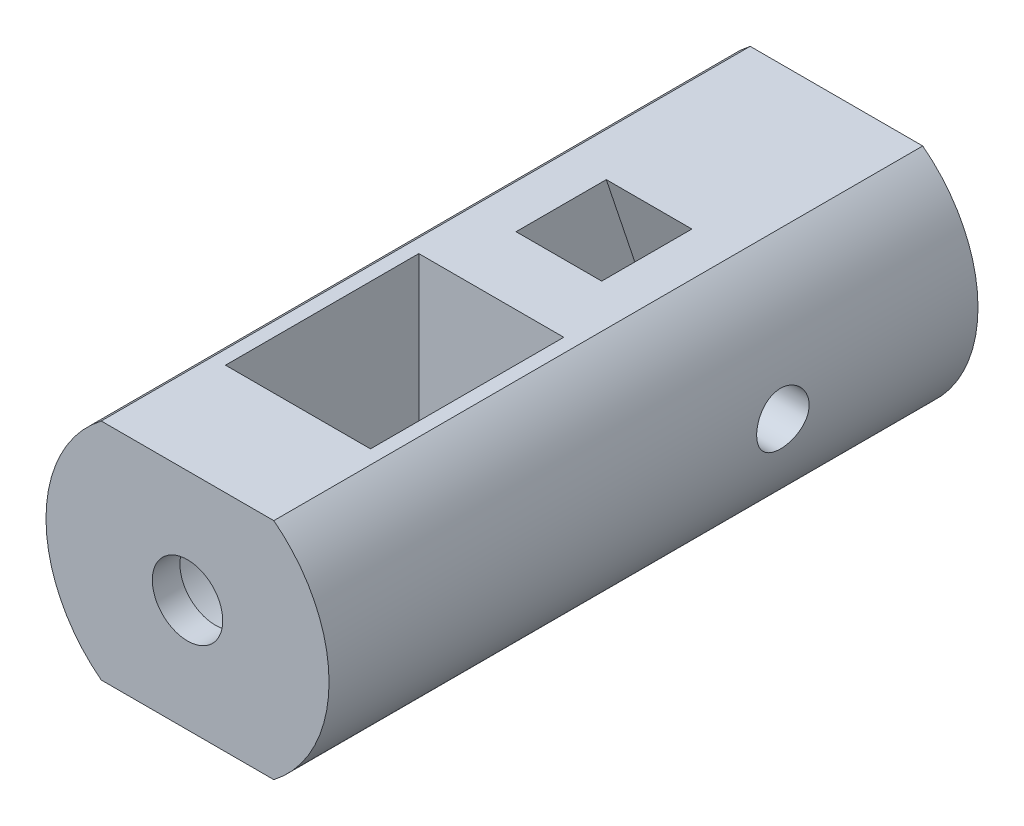
ISO-10303-21;
HEADER;
FILE_DESCRIPTION(('STEP AP214'),'2;1');
FILE_NAME('part.step','',(''),(''),'','','');
FILE_SCHEMA(('AUTOMOTIVE_DESIGN { 1 0 10303 214 1 1 1 1 }'));
ENDSEC;
DATA;
#1=APPLICATION_CONTEXT('core data for automotive mechanical design processes');
#2=APPLICATION_PROTOCOL_DEFINITION('international standard','automotive_design',2000,#1);
#3=PRODUCT_CONTEXT('',#1,'mechanical');
#4=PRODUCT('Part','Part','',(#3));
#5=PRODUCT_RELATED_PRODUCT_CATEGORY('part','',(#4));
#6=PRODUCT_DEFINITION_FORMATION('','',#4);
#7=PRODUCT_DEFINITION_CONTEXT('part definition',#1,'design');
#8=PRODUCT_DEFINITION('design','',#6,#7);
#9=PRODUCT_DEFINITION_SHAPE('','',#8);
#10=(LENGTH_UNIT() NAMED_UNIT(*) SI_UNIT(.MILLI.,.METRE.));
#11=(NAMED_UNIT(*) PLANE_ANGLE_UNIT() SI_UNIT($,.RADIAN.));
#12=(NAMED_UNIT(*) SI_UNIT($,.STERADIAN.) SOLID_ANGLE_UNIT());
#13=UNCERTAINTY_MEASURE_WITH_UNIT(LENGTH_MEASURE(1.E-05),#10,'distance_accuracy_value','');
#14=(GEOMETRIC_REPRESENTATION_CONTEXT(3) GLOBAL_UNCERTAINTY_ASSIGNED_CONTEXT((#13)) GLOBAL_UNIT_ASSIGNED_CONTEXT((#10,
#11,#12)) REPRESENTATION_CONTEXT('',''));
#15=CARTESIAN_POINT('',(0.,0.,0.));
#16=DIRECTION('',(0.,0.,1.));
#17=DIRECTION('',(1.,0.,0.));
#18=AXIS2_PLACEMENT_3D('',#15,#16,#17);
#19=CARTESIAN_POINT('',(5.25,325.527766903838,156.639));
#20=DIRECTION('',(0.,0.,1.));
#21=DIRECTION('',(1.,0.,0.));
#22=AXIS2_PLACEMENT_3D('',#19,#20,#21);
#23=PLANE('',#22);
#24=DIRECTION('',(0.,-1.,0.));
#25=VECTOR('',#24,1.);
#26=CARTESIAN_POINT('',(5.25,325.527766903838,156.639));
#27=LINE('',#26,#25);
#28=CARTESIAN_POINT('',(5.25,325.527766903838,156.639));
#29=VERTEX_POINT('',#28);
#30=CARTESIAN_POINT('',(5.25,317.403728499202,156.639));
#31=VERTEX_POINT('',#30);
#32=EDGE_CURVE('E290',#29,#31,#27,.T.);
#33=ORIENTED_EDGE('',*,*,#32,.T.);
#34=CARTESIAN_POINT('',(0.,317.403728499202,156.639));
#35=DIRECTION('',(0.,0.,-1.));
#36=DIRECTION('',(-1.,0.,0.));
#37=AXIS2_PLACEMENT_3D('',#34,#35,#36);
#38=CIRCLE('',#37,5.25000000000001);
#39=CARTESIAN_POINT('',(-5.25,317.403728499202,156.639));
#40=VERTEX_POINT('',#39);
#41=EDGE_CURVE('E55',#40,#31,#38,.T.);
#42=ORIENTED_EDGE('',*,*,#41,.F.);
#43=DIRECTION('',(0.,-1.,0.));
#44=VECTOR('',#43,1.);
#45=CARTESIAN_POINT('',(-5.25,325.527766903838,156.639));
#46=LINE('',#45,#44);
#47=CARTESIAN_POINT('',(-5.25,325.527766903838,156.639));
#48=VERTEX_POINT('',#47);
#49=EDGE_CURVE('E95',#48,#40,#46,.T.);
#50=ORIENTED_EDGE('',*,*,#49,.F.);
#51=DIRECTION('',(-1.,0.,0.));
#52=VECTOR('',#51,1.);
#53=CARTESIAN_POINT('',(5.25,325.527766903838,156.639));
#54=LINE('',#53,#52);
#55=EDGE_CURVE('E293',#29,#48,#54,.T.);
#56=ORIENTED_EDGE('',*,*,#55,.F.);
#57=EDGE_LOOP('',(#33,#42,#50,#56));
#58=FACE_BOUND('',#57,.T.);
#59=ADVANCED_FACE('F36',(#58),#23,.F.);
#60=CARTESIAN_POINT('',(0.,317.403728499202,164.639));
#61=DIRECTION('',(0.,0.,-1.));
#62=DIRECTION('',(-1.,0.,0.));
#63=AXIS2_PLACEMENT_3D('',#60,#61,#62);
#64=CYLINDRICAL_SURFACE('',#63,10.25);
#65=CARTESIAN_POINT('',(10.25,317.403728499202,133.668709538287));
#66=CARTESIAN_POINT('',(10.2499980928548,317.297975435781,133.66870547407));
#67=CARTESIAN_POINT('',(10.2483464451302,317.192169238842,133.65985045826));
#68=CARTESIAN_POINT('',(10.2419168741179,316.983536895782,133.624686293486));
#69=CARTESIAN_POINT('',(10.2371362869479,316.880713366982,133.598362271685));
#70=CARTESIAN_POINT('',(10.2249837608471,316.681093941061,133.529092579384));
#71=CARTESIAN_POINT('',(10.2176141391839,316.58429274466,133.486161769021));
#72=CARTESIAN_POINT('',(10.201088893425,316.399276520248,133.384938986293));
#73=CARTESIAN_POINT('',(10.1919334202721,316.311060767528,133.32664831202));
#74=CARTESIAN_POINT('',(10.1727275421145,316.144676674545,133.195635306742));
#75=CARTESIAN_POINT('',(10.1626687542421,316.06662348126,133.122767954954));
#76=CARTESIAN_POINT('',(10.1428523589127,315.923776128299,132.964982015465));
#77=CARTESIAN_POINT('',(10.1330947728365,315.858982908052,132.880062574631));
#78=CARTESIAN_POINT('',(10.1149041281788,315.744017678456,132.699771678283));
#79=CARTESIAN_POINT('',(10.106481880874,315.693962452892,132.604324567091));
#80=CARTESIAN_POINT('',(10.0920334444708,315.610641613005,132.406193736844));
#81=CARTESIAN_POINT('',(10.0860070536381,315.57737458503,132.303510627927));
#82=CARTESIAN_POINT('',(10.0771169404786,315.528943299968,132.095053471079));
#83=CARTESIAN_POINT('',(10.0742181993274,315.513578441751,131.989327552121));
#84=CARTESIAN_POINT('',(10.0718059763868,315.500765066804,131.776761709367));
#85=CARTESIAN_POINT('',(10.0722921979701,315.503314980188,131.669921884003));
#86=CARTESIAN_POINT('',(10.0765630708267,315.526096025373,131.459612039586));
#87=CARTESIAN_POINT('',(10.0803052228379,315.5460993494,131.356116353755));
#88=CARTESIAN_POINT('',(10.0905995804368,315.602860766917,131.153975820668));
#89=CARTESIAN_POINT('',(10.0971519029789,315.639619557744,131.055331175495));
#90=CARTESIAN_POINT('',(10.1123729069467,315.729072123961,130.865024672177));
#91=CARTESIAN_POINT('',(10.121053784825,315.781858165026,130.773407198783));
#92=CARTESIAN_POINT('',(10.1395456765845,315.90180154985,130.600244207295));
#93=CARTESIAN_POINT('',(10.1493568026046,315.968960320183,130.518699690268));
#94=CARTESIAN_POINT('',(10.1691890743521,316.116972408385,130.366680880684));
#95=CARTESIAN_POINT('',(10.1792111279809,316.198020643876,130.296396349063));
#96=CARTESIAN_POINT('',(10.1981971233661,316.370858019668,130.170392981237));
#97=CARTESIAN_POINT('',(10.2071610549639,316.462647263076,130.114674284869));
#98=CARTESIAN_POINT('',(10.2230382945575,316.654556936287,130.019357436737));
#99=CARTESIAN_POINT('',(10.2299491300279,316.754687226912,129.97977870099));
#100=CARTESIAN_POINT('',(10.2409223370096,316.960331496721,129.918055424468));
#101=CARTESIAN_POINT('',(10.2449850041513,317.065844915936,129.89590907424));
#102=CARTESIAN_POINT('',(10.2497636063984,317.277627404262,129.869942608806));
#103=CARTESIAN_POINT('',(10.2505270288068,317.383863551839,129.865862438883));
#104=CARTESIAN_POINT('',(10.2487521795687,317.595500215366,129.875447041943));
#105=CARTESIAN_POINT('',(10.2462140663205,317.700900771159,129.889110963616));
#106=CARTESIAN_POINT('',(10.2381508826968,317.90705178097,129.933579658695));
#107=CARTESIAN_POINT('',(10.2326486986208,318.007831526919,129.964253149782));
#108=CARTESIAN_POINT('',(10.2192717674232,318.202817993486,130.041728436695));
#109=CARTESIAN_POINT('',(10.2113968620782,318.29702427524,130.088531308129));
#110=CARTESIAN_POINT('',(10.1940295699932,318.477301623471,130.19751452124));
#111=CARTESIAN_POINT('',(10.1845207672933,318.563274783848,130.259854147634));
#112=CARTESIAN_POINT('',(10.1649835036326,318.723632946761,130.397925356542));
#113=CARTESIAN_POINT('',(10.1549549953804,318.798016892244,130.473658159306));
#114=CARTESIAN_POINT('',(10.1353514808124,318.934070714818,130.63754212224));
#115=CARTESIAN_POINT('',(10.1257840372581,318.995563303987,130.725841518365));
#116=CARTESIAN_POINT('',(10.1083369168713,319.102843287401,130.911669461341));
#117=CARTESIAN_POINT('',(10.1004571782064,319.148631257053,131.009197669886));
#118=CARTESIAN_POINT('',(10.0873367199244,319.222949401487,131.210259793608));
#119=CARTESIAN_POINT('',(10.0820834805117,319.251561582153,131.3137625421));
#120=CARTESIAN_POINT('',(10.0747818991975,319.290969457772,131.524212537455));
#121=CARTESIAN_POINT('',(10.0727332048221,319.301767112185,131.631159404173));
#122=CARTESIAN_POINT('',(10.0720902675276,319.305175025358,131.843686585155));
#123=CARTESIAN_POINT('',(10.0734429208813,319.298064868007,131.949262357129));
#124=CARTESIAN_POINT('',(10.0793326644954,319.266470281166,132.157686147152));
#125=CARTESIAN_POINT('',(10.0838697367461,319.241985949937,132.260534180625));
#126=CARTESIAN_POINT('',(10.0955949726872,319.1764548587,132.460437155635));
#127=CARTESIAN_POINT('',(10.1027783945489,319.135437710517,132.557502100327));
#128=CARTESIAN_POINT('',(10.1189904132999,319.038035671418,132.743417389088));
#129=CARTESIAN_POINT('',(10.1280191364473,318.981649728859,132.832267170459));
#130=CARTESIAN_POINT('',(10.1470696727455,318.854135904176,133.000631819478));
#131=CARTESIAN_POINT('',(10.1571040886309,318.782804302846,133.07999099691));
#132=CARTESIAN_POINT('',(10.1769404422877,318.627849385959,133.22570678517));
#133=CARTESIAN_POINT('',(10.1867423261127,318.54422324989,133.292060404198));
#134=CARTESIAN_POINT('',(10.2051099218599,318.366175110823,133.410424000964));
#135=CARTESIAN_POINT('',(10.2136640394701,318.271664865346,133.462303090404));
#136=CARTESIAN_POINT('',(10.2284591506668,318.075142501036,133.549364174907));
#137=CARTESIAN_POINT('',(10.2347023299185,317.973137580626,133.584561955885));
#138=CARTESIAN_POINT('',(10.2428895790578,317.79297303197,133.630061149416));
#139=CARTESIAN_POINT('',(10.2455410162713,317.715870888263,133.644529696382));
#140=CARTESIAN_POINT('',(10.2490969120148,317.560431701603,133.663855279188));
#141=CARTESIAN_POINT('',(10.2500014132518,317.482094688885,133.668712549994));
#142=CARTESIAN_POINT('',(10.25,317.403728499202,133.668709538287));
#143=B_SPLINE_CURVE_WITH_KNOTS('',3,(#65,#66,#67,#68,#69,#70,#71,#72,#73,#74,#75,#76,#77,#78,
#79,#80,#81,#82,#83,#84,#85,#86,#87,#88,#89,#90,#91,#92,#93,#94,#95,#96,#97,#98,#99,#100,#101,
#102,#103,#104,#105,#106,#107,#108,#109,#110,#111,#112,#113,#114,#115,#116,#117,#118,#119,#120,
#121,#122,#123,#124,#125,#126,#127,#128,#129,#130,#131,#132,#133,#134,#135,#136,#137,#138,#139,
#140,#141,#142),.UNSPECIFIED.,.T.,.F.,(4,2,2,2,2,2,2,2,2,2,2,2,2,2,2,2,2,2,2,2,2,2,2,2,2,2,2,2,
2,2,2,2,2,2,2,2,2,2,4),(0.,0.316972615312287,0.634215442956177,0.951175048645203,
1.26810787604101,1.5883664569062,1.90864771930201,2.23140250568416,2.5541301099291,
2.87320554111227,3.1922530117766,3.50719743124776,3.82215495942192,4.13896116453682,
4.45579882907314,4.77751440283142,5.09923306504545,5.42133761404919,5.74340872472436,
6.06082836923402,6.37823278540525,6.69322085507704,7.00822993417953,7.32661189477882,
7.64502287806666,7.96756090152934,8.29008710613105,8.61106090015209,8.93199938719378,
9.24795841283077,9.56391565156097,9.8793094782536,10.1947248918659,10.5147575627577,
10.8348637678117,11.1577771208717,11.480384280219,11.7152762310882,11.9501624395111),.UNSPECIFIED.);
#144=CARTESIAN_POINT('',(10.25,317.403728499202,133.668709538287));
#145=VERTEX_POINT('',#144);
#146=EDGE_CURVE('E49',#145,#145,#143,.T.);
#147=ORIENTED_EDGE('',*,*,#146,.F.);
#148=EDGE_LOOP('',(#147));
#149=FACE_BOUND('',#148,.T.);
#150=CARTESIAN_POINT('',(0.,317.403728499202,117.639));
#151=DIRECTION('',(0.,0.,-1.));
#152=DIRECTION('',(-1.,0.,0.));
#153=AXIS2_PLACEMENT_3D('',#150,#151,#152);
#154=CIRCLE('',#153,10.25);
#155=CARTESIAN_POINT('',(6.25,325.527766903838,117.639));
#156=VERTEX_POINT('',#155);
#157=CARTESIAN_POINT('',(6.25,309.279690094566,117.639));
#158=VERTEX_POINT('',#157);
#159=EDGE_CURVE('E189',#156,#158,#154,.T.);
#160=ORIENTED_EDGE('',*,*,#159,.F.);
#161=DIRECTION('',(0.,0.,-1.));
#162=VECTOR('',#161,1.);
#163=CARTESIAN_POINT('',(6.25,325.527766903838,164.639));
#164=LINE('',#163,#162);
#165=CARTESIAN_POINT('',(6.25,325.527766903838,164.639));
#166=VERTEX_POINT('',#165);
#167=EDGE_CURVE('E201',#166,#156,#164,.T.);
#168=ORIENTED_EDGE('',*,*,#167,.F.);
#169=CARTESIAN_POINT('',(0.,317.403728499202,164.639));
#170=DIRECTION('',(0.,0.,-1.));
#171=DIRECTION('',(-1.,0.,0.));
#172=AXIS2_PLACEMENT_3D('',#169,#170,#171);
#173=CIRCLE('',#172,10.25);
#174=CARTESIAN_POINT('',(6.25,309.279690094566,164.639));
#175=VERTEX_POINT('',#174);
#176=EDGE_CURVE('E175',#166,#175,#173,.T.);
#177=ORIENTED_EDGE('',*,*,#176,.T.);
#178=DIRECTION('',(0.,0.,-1.));
#179=VECTOR('',#178,1.);
#180=CARTESIAN_POINT('',(6.25,309.279690094566,164.639));
#181=LINE('',#180,#179);
#182=EDGE_CURVE('E188',#175,#158,#181,.T.);
#183=ORIENTED_EDGE('',*,*,#182,.T.);
#184=EDGE_LOOP('',(#160,#168,#177,#183));
#185=FACE_BOUND('',#184,.T.);
#186=ADVANCED_FACE('F219',(#149,#185),#64,.T.);
#187=CARTESIAN_POINT('',(-6.25,325.527766903838,164.639));
#188=DIRECTION('',(0.,1.,0.));
#189=DIRECTION('',(0.,0.,1.));
#190=AXIS2_PLACEMENT_3D('',#187,#188,#189);
#191=PLANE('',#190);
#192=DIRECTION('',(0.,0.,-1.));
#193=VECTOR('',#192,1.);
#194=CARTESIAN_POINT('',(-5.25,325.527766903838,156.639));
#195=LINE('',#194,#193);
#196=CARTESIAN_POINT('',(-5.25,325.527766903838,142.639));
#197=VERTEX_POINT('',#196);
#198=EDGE_CURVE('E323',#48,#197,#195,.T.);
#199=ORIENTED_EDGE('',*,*,#198,.T.);
#200=DIRECTION('',(1.,0.,0.));
#201=VECTOR('',#200,1.);
#202=CARTESIAN_POINT('',(-5.25,325.527766903838,142.639));
#203=LINE('',#202,#201);
#204=CARTESIAN_POINT('',(5.25,325.527766903838,142.639));
#205=VERTEX_POINT('',#204);
#206=EDGE_CURVE('E310',#197,#205,#203,.T.);
#207=ORIENTED_EDGE('',*,*,#206,.T.);
#208=DIRECTION('',(0.,0.,1.));
#209=VECTOR('',#208,1.);
#210=CARTESIAN_POINT('',(5.25,325.527766903838,142.639));
#211=LINE('',#210,#209);
#212=EDGE_CURVE('E64',#205,#29,#211,.T.);
#213=ORIENTED_EDGE('',*,*,#212,.T.);
#214=ORIENTED_EDGE('',*,*,#55,.T.);
#215=EDGE_LOOP('',(#199,#207,#213,#214));
#216=FACE_BOUND('',#215,.T.);
#217=DIRECTION('',(0.,0.,1.));
#218=VECTOR('',#217,1.);
#219=CARTESIAN_POINT('',(-3.1,325.527766903838,125.793009821235));
#220=LINE('',#219,#218);
#221=CARTESIAN_POINT('',(-3.1,325.527766903838,131.209035424326));
#222=VERTEX_POINT('',#221);
#223=CARTESIAN_POINT('',(-3.1,325.527766903838,137.74440925534));
#224=VERTEX_POINT('',#223);
#225=EDGE_CURVE('E171',#222,#224,#220,.T.);
#226=ORIENTED_EDGE('',*,*,#225,.F.);
#227=DIRECTION('',(1.,0.,0.));
#228=VECTOR('',#227,1.);
#229=CARTESIAN_POINT('',(-6.25,325.527766903838,131.209035424326));
#230=LINE('',#229,#228);
#231=CARTESIAN_POINT('',(3.1,325.527766903838,131.209035424326));
#232=VERTEX_POINT('',#231);
#233=EDGE_CURVE('E166',#232,#222,#230,.F.);
#234=ORIENTED_EDGE('',*,*,#233,.F.);
#235=DIRECTION('',(0.,0.,-1.));
#236=VECTOR('',#235,1.);
#237=CARTESIAN_POINT('',(3.1,325.527766903838,132.328383652249));
#238=LINE('',#237,#236);
#239=CARTESIAN_POINT('',(3.1,325.527766903838,137.74440925534));
#240=VERTEX_POINT('',#239);
#241=EDGE_CURVE('E173',#240,#232,#238,.T.);
#242=ORIENTED_EDGE('',*,*,#241,.F.);
#243=DIRECTION('',(-1.,0.,0.));
#244=VECTOR('',#243,1.);
#245=CARTESIAN_POINT('',(-6.25,325.527766903838,137.74440925534));
#246=LINE('',#245,#244);
#247=EDGE_CURVE('E157',#224,#240,#246,.F.);
#248=ORIENTED_EDGE('',*,*,#247,.F.);
#249=EDGE_LOOP('',(#226,#234,#242,#248));
#250=FACE_BOUND('',#249,.T.);
#251=DIRECTION('',(1.,0.,0.));
#252=VECTOR('',#251,1.);
#253=CARTESIAN_POINT('',(-6.25,325.527766903838,117.639));
#254=LINE('',#253,#252);
#255=CARTESIAN_POINT('',(-6.25,325.527766903838,117.639));
#256=VERTEX_POINT('',#255);
#257=EDGE_CURVE('E179',#256,#156,#254,.T.);
#258=ORIENTED_EDGE('',*,*,#257,.F.);
#259=DIRECTION('',(0.,0.,-1.));
#260=VECTOR('',#259,1.);
#261=CARTESIAN_POINT('',(-6.25,325.527766903838,164.639));
#262=LINE('',#261,#260);
#263=CARTESIAN_POINT('',(-6.25,325.527766903838,164.639));
#264=VERTEX_POINT('',#263);
#265=EDGE_CURVE('E203',#264,#256,#262,.T.);
#266=ORIENTED_EDGE('',*,*,#265,.F.);
#267=DIRECTION('',(1.,0.,0.));
#268=VECTOR('',#267,1.);
#269=CARTESIAN_POINT('',(-6.25,325.527766903838,164.639));
#270=LINE('',#269,#268);
#271=EDGE_CURVE('E185',#264,#166,#270,.T.);
#272=ORIENTED_EDGE('',*,*,#271,.T.);
#273=ORIENTED_EDGE('',*,*,#167,.T.);
#274=EDGE_LOOP('',(#258,#266,#272,#273));
#275=FACE_BOUND('',#274,.T.);
#276=ADVANCED_FACE('F272',(#216,#250,#275),#191,.T.);
#277=CARTESIAN_POINT('',(0.,317.403728499202,164.639));
#278=DIRECTION('',(0.,0.,-1.));
#279=DIRECTION('',(-1.,0.,0.));
#280=AXIS2_PLACEMENT_3D('',#277,#278,#279);
#281=CYLINDRICAL_SURFACE('',#280,10.25);
#282=CARTESIAN_POINT('',(-10.25,317.403728499202,129.868709538287));
#283=CARTESIAN_POINT('',(-10.2499980928548,317.297975435781,129.868713602504));
#284=CARTESIAN_POINT('',(-10.2483464451302,317.192169238842,129.877568618314));
#285=CARTESIAN_POINT('',(-10.2419168741179,316.983536895782,129.912732783088));
#286=CARTESIAN_POINT('',(-10.2371362869479,316.880713366982,129.939056804889));
#287=CARTESIAN_POINT('',(-10.2249837608471,316.681093941061,130.00832649719));
#288=CARTESIAN_POINT('',(-10.2176141391839,316.58429274466,130.051257307553));
#289=CARTESIAN_POINT('',(-10.201088893425,316.399276520248,130.152480090281));
#290=CARTESIAN_POINT('',(-10.1919334202721,316.311060767528,130.210770764554));
#291=CARTESIAN_POINT('',(-10.1727275421145,316.144676674545,130.341783769832));
#292=CARTESIAN_POINT('',(-10.1626687542421,316.06662348126,130.414651121621));
#293=CARTESIAN_POINT('',(-10.1428523589127,315.923776128299,130.572437061109));
#294=CARTESIAN_POINT('',(-10.1330947728365,315.858982908052,130.657356501943));
#295=CARTESIAN_POINT('',(-10.1149041281788,315.744017678456,130.837647398291));
#296=CARTESIAN_POINT('',(-10.106481880874,315.693962452892,130.933094509483));
#297=CARTESIAN_POINT('',(-10.0920334444708,315.610641613005,131.13122533973));
#298=CARTESIAN_POINT('',(-10.0860070536381,315.57737458503,131.233908448647));
#299=CARTESIAN_POINT('',(-10.0771169404786,315.528943299968,131.442365605495));
#300=CARTESIAN_POINT('',(-10.0742181993274,315.513578441751,131.548091524453));
#301=CARTESIAN_POINT('',(-10.0718059763868,315.500765066804,131.760657367207));
#302=CARTESIAN_POINT('',(-10.0722921979701,315.503314980188,131.867497192571));
#303=CARTESIAN_POINT('',(-10.0765630708267,315.526096025373,132.077807036988));
#304=CARTESIAN_POINT('',(-10.0803052228379,315.5460993494,132.181302722819));
#305=CARTESIAN_POINT('',(-10.0905995804368,315.602860766917,132.383443255906));
#306=CARTESIAN_POINT('',(-10.0971519029789,315.639619557744,132.482087901079));
#307=CARTESIAN_POINT('',(-10.1123729069467,315.729072123961,132.672394404397));
#308=CARTESIAN_POINT('',(-10.121053784825,315.781858165026,132.764011877791));
#309=CARTESIAN_POINT('',(-10.1395456765845,315.90180154985,132.937174869279));
#310=CARTESIAN_POINT('',(-10.1493568026046,315.968960320183,133.018719386306));
#311=CARTESIAN_POINT('',(-10.1691890743521,316.116972408385,133.17073819589));
#312=CARTESIAN_POINT('',(-10.1792111279809,316.198020643876,133.241022727511));
#313=CARTESIAN_POINT('',(-10.1981971233661,316.370858019668,133.367026095337));
#314=CARTESIAN_POINT('',(-10.2071610549639,316.462647263076,133.422744791705));
#315=CARTESIAN_POINT('',(-10.2230382945575,316.654556936287,133.518061639837));
#316=CARTESIAN_POINT('',(-10.2299491300279,316.754687226912,133.557640375584));
#317=CARTESIAN_POINT('',(-10.2409223370096,316.960331496721,133.619363652106));
#318=CARTESIAN_POINT('',(-10.2449850041513,317.065844915936,133.641510002334));
#319=CARTESIAN_POINT('',(-10.2497636063984,317.277627404262,133.667476467768));
#320=CARTESIAN_POINT('',(-10.2505270288068,317.383863551839,133.671556637692));
#321=CARTESIAN_POINT('',(-10.2487521795687,317.595500215366,133.661972034631));
#322=CARTESIAN_POINT('',(-10.2462140663205,317.700900771159,133.648308112958));
#323=CARTESIAN_POINT('',(-10.2381508826968,317.90705178097,133.603839417879));
#324=CARTESIAN_POINT('',(-10.2326486986208,318.007831526919,133.573165926792));
#325=CARTESIAN_POINT('',(-10.2192717674232,318.202817993486,133.495690639879));
#326=CARTESIAN_POINT('',(-10.2113968620782,318.29702427524,133.448887768445));
#327=CARTESIAN_POINT('',(-10.1940295699932,318.477301623471,133.339904555334));
#328=CARTESIAN_POINT('',(-10.1845207672933,318.563274783848,133.27756492894));
#329=CARTESIAN_POINT('',(-10.1649835036326,318.723632946761,133.139493720032));
#330=CARTESIAN_POINT('',(-10.1549549953804,318.798016892244,133.063760917268));
#331=CARTESIAN_POINT('',(-10.1353514808124,318.934070714818,132.899876954334));
#332=CARTESIAN_POINT('',(-10.1257840372581,318.995563303987,132.811577558209));
#333=CARTESIAN_POINT('',(-10.1083369168713,319.102843287401,132.625749615233));
#334=CARTESIAN_POINT('',(-10.1004571782064,319.148631257053,132.528221406688));
#335=CARTESIAN_POINT('',(-10.0873367199244,319.222949401487,132.327159282966));
#336=CARTESIAN_POINT('',(-10.0820834805117,319.251561582153,132.223656534474));
#337=CARTESIAN_POINT('',(-10.0747818991975,319.290969457772,132.013206539119));
#338=CARTESIAN_POINT('',(-10.0727332048221,319.301767112185,131.906259672401));
#339=CARTESIAN_POINT('',(-10.0720902675276,319.305175025358,131.693732491419));
#340=CARTESIAN_POINT('',(-10.0734429208813,319.298064868007,131.588156719445));
#341=CARTESIAN_POINT('',(-10.0793326644954,319.266470281166,131.379732929422));
#342=CARTESIAN_POINT('',(-10.0838697367461,319.241985949937,131.276884895949));
#343=CARTESIAN_POINT('',(-10.0955949726872,319.1764548587,131.076981920939));
#344=CARTESIAN_POINT('',(-10.1027783945489,319.135437710517,130.979916976247));
#345=CARTESIAN_POINT('',(-10.1189904132999,319.038035671418,130.794001687486));
#346=CARTESIAN_POINT('',(-10.1280191364473,318.981649728859,130.705151906115));
#347=CARTESIAN_POINT('',(-10.1470696727455,318.854135904176,130.536787257096));
#348=CARTESIAN_POINT('',(-10.1571040886309,318.782804302846,130.457428079664));
#349=CARTESIAN_POINT('',(-10.1769404422877,318.627849385959,130.311712291404));
#350=CARTESIAN_POINT('',(-10.1867423261127,318.54422324989,130.245358672376));
#351=CARTESIAN_POINT('',(-10.2051099218599,318.366175110823,130.12699507561));
#352=CARTESIAN_POINT('',(-10.2136640394701,318.271664865346,130.07511598617));
#353=CARTESIAN_POINT('',(-10.2284591506668,318.075142501036,129.988054901667));
#354=CARTESIAN_POINT('',(-10.2347023299185,317.973137580626,129.952857120689));
#355=CARTESIAN_POINT('',(-10.2428895790578,317.79297303197,129.907357927158));
#356=CARTESIAN_POINT('',(-10.2455410162713,317.715870888263,129.892889380192));
#357=CARTESIAN_POINT('',(-10.2490969120148,317.560431701603,129.873563797386));
#358=CARTESIAN_POINT('',(-10.2500014132518,317.482094688885,129.86870652658));
#359=CARTESIAN_POINT('',(-10.25,317.403728499202,129.868709538287));
#360=B_SPLINE_CURVE_WITH_KNOTS('',3,(#282,#283,#284,#285,#286,#287,#288,#289,#290,#291,#292,
#293,#294,#295,#296,#297,#298,#299,#300,#301,#302,#303,#304,#305,#306,#307,#308,#309,#310,#311,
#312,#313,#314,#315,#316,#317,#318,#319,#320,#321,#322,#323,#324,#325,#326,#327,#328,#329,#330,
#331,#332,#333,#334,#335,#336,#337,#338,#339,#340,#341,#342,#343,#344,#345,#346,#347,#348,#349,
#350,#351,#352,#353,#354,#355,#356,#357,#358,#359),.UNSPECIFIED.,.T.,.F.,(4,2,2,2,2,2,2,2,2,2,2,
2,2,2,2,2,2,2,2,2,2,2,2,2,2,2,2,2,2,2,2,2,2,2,2,2,2,2,4),(0.,0.316972615312287,
0.634215442956177,0.951175048645203,1.26810787604101,1.5883664569062,1.90864771930201,
2.23140250568416,2.5541301099291,2.87320554111227,3.1922530117766,3.50719743124776,
3.82215495942192,4.13896116453682,4.45579882907314,4.77751440283142,5.09923306504545,
5.42133761404919,5.74340872472436,6.06082836923402,6.37823278540525,6.69322085507704,
7.00822993417953,7.32661189477884,7.64502287806666,7.96756090152934,8.29008710613105,
8.61106090015209,8.93199938719378,9.24795841283077,9.56391565156096,9.8793094782536,
10.1947248918659,10.5147575627577,10.8348637678117,11.1577771208717,11.480384280219,
11.7152762310882,11.9501624395111),.UNSPECIFIED.);
#361=CARTESIAN_POINT('',(-10.25,317.403728499202,129.868709538287));
#362=VERTEX_POINT('',#361);
#363=EDGE_CURVE('E11',#362,#362,#360,.T.);
#364=ORIENTED_EDGE('',*,*,#363,.F.);
#365=EDGE_LOOP('',(#364));
#366=FACE_BOUND('',#365,.T.);
#367=CARTESIAN_POINT('',(0.,317.403728499202,117.639));
#368=DIRECTION('',(0.,0.,-1.));
#369=DIRECTION('',(-1.,0.,0.));
#370=AXIS2_PLACEMENT_3D('',#367,#368,#369);
#371=CIRCLE('',#370,10.25);
#372=CARTESIAN_POINT('',(-6.25,309.279690094566,117.639));
#373=VERTEX_POINT('',#372);
#374=EDGE_CURVE('E196',#373,#256,#371,.T.);
#375=ORIENTED_EDGE('',*,*,#374,.F.);
#376=DIRECTION('',(0.,0.,-1.));
#377=VECTOR('',#376,1.);
#378=CARTESIAN_POINT('',(-6.25,309.279690094566,164.639));
#379=LINE('',#378,#377);
#380=CARTESIAN_POINT('',(-6.25,309.279690094566,164.639));
#381=VERTEX_POINT('',#380);
#382=EDGE_CURVE('E205',#381,#373,#379,.T.);
#383=ORIENTED_EDGE('',*,*,#382,.F.);
#384=CARTESIAN_POINT('',(0.,317.403728499202,164.639));
#385=DIRECTION('',(0.,0.,-1.));
#386=DIRECTION('',(-1.,0.,0.));
#387=AXIS2_PLACEMENT_3D('',#384,#385,#386);
#388=CIRCLE('',#387,10.25);
#389=EDGE_CURVE('E182',#381,#264,#388,.T.);
#390=ORIENTED_EDGE('',*,*,#389,.T.);
#391=ORIENTED_EDGE('',*,*,#265,.T.);
#392=EDGE_LOOP('',(#375,#383,#390,#391));
#393=FACE_BOUND('',#392,.T.);
#394=ADVANCED_FACE('F274',(#366,#393),#281,.T.);
#395=CARTESIAN_POINT('',(6.25,309.279690094566,164.639));
#396=DIRECTION('',(0.,-1.,0.));
#397=DIRECTION('',(0.,0.,-1.));
#398=AXIS2_PLACEMENT_3D('',#395,#396,#397);
#399=PLANE('',#398);
#400=DIRECTION('',(0.,0.,-1.));
#401=VECTOR('',#400,1.);
#402=CARTESIAN_POINT('',(-5.25,309.279690094566,156.639));
#403=LINE('',#402,#401);
#404=CARTESIAN_POINT('',(-5.25,309.279690094566,156.639));
#405=VERTEX_POINT('',#404);
#406=CARTESIAN_POINT('',(-5.25,309.279690094566,142.639));
#407=VERTEX_POINT('',#406);
#408=EDGE_CURVE('E314',#405,#407,#403,.T.);
#409=ORIENTED_EDGE('',*,*,#408,.F.);
#410=DIRECTION('',(-1.,0.,0.));
#411=VECTOR('',#410,1.);
#412=CARTESIAN_POINT('',(5.25,309.279690094566,156.639));
#413=LINE('',#412,#411);
#414=CARTESIAN_POINT('',(5.25,309.279690094566,156.639));
#415=VERTEX_POINT('',#414);
#416=EDGE_CURVE('E321',#415,#405,#413,.T.);
#417=ORIENTED_EDGE('',*,*,#416,.F.);
#418=DIRECTION('',(0.,0.,1.));
#419=VECTOR('',#418,1.);
#420=CARTESIAN_POINT('',(5.25,309.279690094566,142.639));
#421=LINE('',#420,#419);
#422=CARTESIAN_POINT('',(5.25,309.279690094566,142.639));
#423=VERTEX_POINT('',#422);
#424=EDGE_CURVE('E319',#423,#415,#421,.T.);
#425=ORIENTED_EDGE('',*,*,#424,.F.);
#426=DIRECTION('',(1.,0.,0.));
#427=VECTOR('',#426,1.);
#428=CARTESIAN_POINT('',(-5.25,309.279690094566,142.639));
#429=LINE('',#428,#427);
#430=EDGE_CURVE('E316',#407,#423,#429,.T.);
#431=ORIENTED_EDGE('',*,*,#430,.F.);
#432=EDGE_LOOP('',(#409,#417,#425,#431));
#433=FACE_BOUND('',#432,.T.);
#434=DIRECTION('',(0.,0.,1.));
#435=VECTOR('',#434,1.);
#436=CARTESIAN_POINT('',(-3.1,309.279690094566,125.793009821235));
#437=LINE('',#436,#435);
#438=CARTESIAN_POINT('',(-3.1,309.279690094566,125.793009821235));
#439=VERTEX_POINT('',#438);
#440=CARTESIAN_POINT('',(-3.1,309.279690094566,132.328383652249));
#441=VERTEX_POINT('',#440);
#442=EDGE_CURVE('E164',#439,#441,#437,.T.);
#443=ORIENTED_EDGE('',*,*,#442,.T.);
#444=DIRECTION('',(1.,0.,0.));
#445=VECTOR('',#444,1.);
#446=CARTESIAN_POINT('',(-3.1,309.279690094566,132.328383652249));
#447=LINE('',#446,#445);
#448=CARTESIAN_POINT('',(3.1,309.279690094566,132.328383652249));
#449=VERTEX_POINT('',#448);
#450=EDGE_CURVE('E150',#441,#449,#447,.T.);
#451=ORIENTED_EDGE('',*,*,#450,.T.);
#452=DIRECTION('',(0.,0.,-1.));
#453=VECTOR('',#452,1.);
#454=CARTESIAN_POINT('',(3.1,309.279690094566,132.328383652249));
#455=LINE('',#454,#453);
#456=CARTESIAN_POINT('',(3.1,309.279690094566,125.793009821235));
#457=VERTEX_POINT('',#456);
#458=EDGE_CURVE('E142',#449,#457,#455,.T.);
#459=ORIENTED_EDGE('',*,*,#458,.T.);
#460=DIRECTION('',(-1.,0.,0.));
#461=VECTOR('',#460,1.);
#462=CARTESIAN_POINT('',(3.1,309.279690094566,125.793009821235));
#463=LINE('',#462,#461);
#464=EDGE_CURVE('E149',#457,#439,#463,.T.);
#465=ORIENTED_EDGE('',*,*,#464,.T.);
#466=EDGE_LOOP('',(#443,#451,#459,#465));
#467=FACE_BOUND('',#466,.T.);
#468=DIRECTION('',(-1.,0.,0.));
#469=VECTOR('',#468,1.);
#470=CARTESIAN_POINT('',(6.25,309.279690094566,117.639));
#471=LINE('',#470,#469);
#472=EDGE_CURVE('E192',#158,#373,#471,.T.);
#473=ORIENTED_EDGE('',*,*,#472,.F.);
#474=ORIENTED_EDGE('',*,*,#182,.F.);
#475=DIRECTION('',(-1.,0.,0.));
#476=VECTOR('',#475,1.);
#477=CARTESIAN_POINT('',(6.25,309.279690094566,164.639));
#478=LINE('',#477,#476);
#479=EDGE_CURVE('E178',#175,#381,#478,.T.);
#480=ORIENTED_EDGE('',*,*,#479,.T.);
#481=ORIENTED_EDGE('',*,*,#382,.T.);
#482=EDGE_LOOP('',(#473,#474,#480,#481));
#483=FACE_BOUND('',#482,.T.);
#484=ADVANCED_FACE('F161',(#433,#467,#483),#399,.T.);
#485=CARTESIAN_POINT('',(0.,317.403728499202,164.639));
#486=DIRECTION('',(0.,0.,-1.));
#487=DIRECTION('',(-1.,0.,0.));
#488=AXIS2_PLACEMENT_3D('',#485,#486,#487);
#489=PLANE('',#488);
#490=CARTESIAN_POINT('',(0.,317.403728499202,164.639));
#491=DIRECTION('',(0.,0.,-1.));
#492=DIRECTION('',(-1.,0.,0.));
#493=AXIS2_PLACEMENT_3D('',#490,#491,#492);
#494=CIRCLE('',#493,2.55000000000001);
#495=CARTESIAN_POINT('',(-2.55000000000001,317.403728499202,164.639));
#496=VERTEX_POINT('',#495);
#497=EDGE_CURVE('E317',#496,#496,#494,.T.);
#498=ORIENTED_EDGE('',*,*,#497,.T.);
#499=EDGE_LOOP('',(#498));
#500=FACE_BOUND('',#499,.T.);
#501=ORIENTED_EDGE('',*,*,#176,.F.);
#502=ORIENTED_EDGE('',*,*,#271,.F.);
#503=ORIENTED_EDGE('',*,*,#389,.F.);
#504=ORIENTED_EDGE('',*,*,#479,.F.);
#505=EDGE_LOOP('',(#501,#502,#503,#504));
#506=FACE_BOUND('',#505,.T.);
#507=ADVANCED_FACE('F265',(#500,#506),#489,.F.);
#508=CARTESIAN_POINT('',(0.,317.403728499202,117.639));
#509=DIRECTION('',(0.,0.,-1.));
#510=DIRECTION('',(-1.,0.,0.));
#511=AXIS2_PLACEMENT_3D('',#508,#509,#510);
#512=PLANE('',#511);
#513=ORIENTED_EDGE('',*,*,#159,.T.);
#514=ORIENTED_EDGE('',*,*,#472,.T.);
#515=ORIENTED_EDGE('',*,*,#374,.T.);
#516=ORIENTED_EDGE('',*,*,#257,.T.);
#517=EDGE_LOOP('',(#513,#514,#515,#516));
#518=FACE_BOUND('',#517,.T.);
#519=ADVANCED_FACE('F263',(#518),#512,.T.);
#520=CARTESIAN_POINT('',(-3.1,309.279690094566,125.793009821235));
#521=DIRECTION('',(-1.,0.,0.));
#522=DIRECTION('',(0.,0.,1.));
#523=AXIS2_PLACEMENT_3D('',#520,#521,#522);
#524=PLANE('',#523);
#525=CARTESIAN_POINT('',(-3.1,317.403728499202,131.768709538287));
#526=DIRECTION('',(1.,0.,0.));
#527=DIRECTION('',(0.,0.,-1.));
#528=AXIS2_PLACEMENT_3D('',#525,#526,#527);
#529=CIRCLE('',#528,1.90000000000001);
#530=CARTESIAN_POINT('',(-3.1,317.403728499202,129.868709538287));
#531=VERTEX_POINT('',#530);
#532=EDGE_CURVE('E341',#531,#531,#529,.T.);
#533=ORIENTED_EDGE('',*,*,#532,.F.);
#534=EDGE_LOOP('',(#533));
#535=FACE_BOUND('',#534,.T.);
#536=ORIENTED_EDGE('',*,*,#225,.T.);
#537=DIRECTION('',(0.,-0.948683298050515,-0.316227766016834));
#538=VECTOR('',#537,1.);
#539=CARTESIAN_POINT('',(-3.1,307.319077945262,131.674846269148));
#540=LINE('',#539,#538);
#541=EDGE_CURVE('E159',#441,#224,#540,.F.);
#542=ORIENTED_EDGE('',*,*,#541,.F.);
#543=ORIENTED_EDGE('',*,*,#442,.F.);
#544=DIRECTION('',(0.,-0.948683298050513,-0.316227766016841));
#545=VECTOR('',#544,1.);
#546=CARTESIAN_POINT('',(-3.1,309.279690094566,125.793009821235));
#547=LINE('',#546,#545);
#548=EDGE_CURVE('E193',#439,#222,#547,.F.);
#549=ORIENTED_EDGE('',*,*,#548,.T.);
#550=EDGE_LOOP('',(#536,#542,#543,#549));
#551=FACE_BOUND('',#550,.T.);
#552=ADVANCED_FACE('F260',(#535,#551),#524,.F.);
#553=CARTESIAN_POINT('',(3.1,309.279690094566,125.793009821235));
#554=DIRECTION('',(0.,-0.316227766016841,0.948683298050513));
#555=DIRECTION('',(0.,-0.948683298050513,-0.316227766016841));
#556=AXIS2_PLACEMENT_3D('',#553,#554,#555);
#557=PLANE('',#556);
#558=ORIENTED_EDGE('',*,*,#233,.T.);
#559=ORIENTED_EDGE('',*,*,#548,.F.);
#560=ORIENTED_EDGE('',*,*,#464,.F.);
#561=DIRECTION('',(0.,-0.948683298050513,-0.316227766016841));
#562=VECTOR('',#561,1.);
#563=CARTESIAN_POINT('',(3.1,311.24030224387,126.446547204336));
#564=LINE('',#563,#562);
#565=EDGE_CURVE('E144',#457,#232,#564,.F.);
#566=ORIENTED_EDGE('',*,*,#565,.T.);
#567=EDGE_LOOP('',(#558,#559,#560,#566));
#568=FACE_BOUND('',#567,.T.);
#569=ADVANCED_FACE('F258',(#568),#557,.T.);
#570=CARTESIAN_POINT('',(3.1,309.279690094566,132.328383652249));
#571=DIRECTION('',(1.,0.,0.));
#572=DIRECTION('',(0.,0.,-1.));
#573=AXIS2_PLACEMENT_3D('',#570,#571,#572);
#574=PLANE('',#573);
#575=CARTESIAN_POINT('',(3.1,317.403728499202,131.768709538287));
#576=DIRECTION('',(-1.,0.,0.));
#577=DIRECTION('',(0.,0.,1.));
#578=AXIS2_PLACEMENT_3D('',#575,#576,#577);
#579=CIRCLE('',#578,1.90000000000001);
#580=CARTESIAN_POINT('',(3.1,317.403728499202,133.668709538287));
#581=VERTEX_POINT('',#580);
#582=EDGE_CURVE('E338',#581,#581,#579,.T.);
#583=ORIENTED_EDGE('',*,*,#582,.F.);
#584=EDGE_LOOP('',(#583));
#585=FACE_BOUND('',#584,.T.);
#586=ORIENTED_EDGE('',*,*,#241,.T.);
#587=ORIENTED_EDGE('',*,*,#565,.F.);
#588=ORIENTED_EDGE('',*,*,#458,.F.);
#589=DIRECTION('',(0.,-0.948683298050515,-0.316227766016834));
#590=VECTOR('',#589,1.);
#591=CARTESIAN_POINT('',(3.1,309.279690094566,132.328383652249));
#592=LINE('',#591,#590);
#593=EDGE_CURVE('E87',#449,#240,#592,.F.);
#594=ORIENTED_EDGE('',*,*,#593,.T.);
#595=EDGE_LOOP('',(#586,#587,#588,#594));
#596=FACE_BOUND('',#595,.T.);
#597=ADVANCED_FACE('F143',(#585,#596),#574,.F.);
#598=CARTESIAN_POINT('',(-3.1,309.279690094566,132.328383652249));
#599=DIRECTION('',(0.,0.316227766016834,-0.948683298050515));
#600=DIRECTION('',(0.,0.948683298050515,0.316227766016834));
#601=AXIS2_PLACEMENT_3D('',#598,#599,#600);
#602=PLANE('',#601);
#603=ORIENTED_EDGE('',*,*,#247,.T.);
#604=ORIENTED_EDGE('',*,*,#593,.F.);
#605=ORIENTED_EDGE('',*,*,#450,.F.);
#606=ORIENTED_EDGE('',*,*,#541,.T.);
#607=EDGE_LOOP('',(#603,#604,#605,#606));
#608=FACE_BOUND('',#607,.T.);
#609=ADVANCED_FACE('F38',(#608),#602,.T.);
#610=CARTESIAN_POINT('',(-5.25,325.527766903838,156.639));
#611=DIRECTION('',(-1.,0.,0.));
#612=DIRECTION('',(0.,0.,1.));
#613=AXIS2_PLACEMENT_3D('',#610,#611,#612);
#614=PLANE('',#613);
#615=ORIENTED_EDGE('',*,*,#408,.T.);
#616=DIRECTION('',(0.,-1.,0.));
#617=VECTOR('',#616,1.);
#618=CARTESIAN_POINT('',(-5.25,325.527766903838,142.639));
#619=LINE('',#618,#617);
#620=EDGE_CURVE('E302',#197,#407,#619,.T.);
#621=ORIENTED_EDGE('',*,*,#620,.F.);
#622=ORIENTED_EDGE('',*,*,#198,.F.);
#623=ORIENTED_EDGE('',*,*,#49,.T.);
#624=EDGE_CURVE('E295',#40,#405,#46,.T.);
#625=ORIENTED_EDGE('',*,*,#624,.T.);
#626=EDGE_LOOP('',(#615,#621,#622,#623,#625));
#627=FACE_BOUND('',#626,.T.);
#628=ADVANCED_FACE('F246',(#627),#614,.F.);
#629=ORIENTED_EDGE('',*,*,#624,.F.);
#630=EDGE_CURVE('E337',#31,#40,#38,.T.);
#631=ORIENTED_EDGE('',*,*,#630,.F.);
#632=EDGE_CURVE('E296',#31,#415,#27,.T.);
#633=ORIENTED_EDGE('',*,*,#632,.T.);
#634=ORIENTED_EDGE('',*,*,#416,.T.);
#635=EDGE_LOOP('',(#629,#631,#633,#634));
#636=FACE_BOUND('',#635,.T.);
#637=ADVANCED_FACE('F242',(#636),#23,.F.);
#638=CARTESIAN_POINT('',(5.25,325.527766903838,142.639));
#639=DIRECTION('',(1.,0.,0.));
#640=DIRECTION('',(0.,0.,-1.));
#641=AXIS2_PLACEMENT_3D('',#638,#639,#640);
#642=PLANE('',#641);
#643=ORIENTED_EDGE('',*,*,#424,.T.);
#644=ORIENTED_EDGE('',*,*,#632,.F.);
#645=ORIENTED_EDGE('',*,*,#32,.F.);
#646=ORIENTED_EDGE('',*,*,#212,.F.);
#647=DIRECTION('',(0.,-1.,0.));
#648=VECTOR('',#647,1.);
#649=CARTESIAN_POINT('',(5.25,325.527766903838,142.639));
#650=LINE('',#649,#648);
#651=EDGE_CURVE('E299',#205,#423,#650,.T.);
#652=ORIENTED_EDGE('',*,*,#651,.T.);
#653=EDGE_LOOP('',(#643,#644,#645,#646,#652));
#654=FACE_BOUND('',#653,.T.);
#655=ADVANCED_FACE('F245',(#654),#642,.F.);
#656=CARTESIAN_POINT('',(-5.25,325.527766903838,142.639));
#657=DIRECTION('',(0.,0.,-1.));
#658=DIRECTION('',(-1.,0.,0.));
#659=AXIS2_PLACEMENT_3D('',#656,#657,#658);
#660=PLANE('',#659);
#661=ORIENTED_EDGE('',*,*,#430,.T.);
#662=ORIENTED_EDGE('',*,*,#651,.F.);
#663=ORIENTED_EDGE('',*,*,#206,.F.);
#664=ORIENTED_EDGE('',*,*,#620,.T.);
#665=EDGE_LOOP('',(#661,#662,#663,#664));
#666=FACE_BOUND('',#665,.T.);
#667=ADVANCED_FACE('F240',(#666),#660,.F.);
#668=CARTESIAN_POINT('',(0.,317.403728499202,156.639));
#669=DIRECTION('',(0.,0.,-1.));
#670=DIRECTION('',(-1.,0.,0.));
#671=AXIS2_PLACEMENT_3D('',#668,#669,#670);
#672=CYLINDRICAL_SURFACE('',#671,2.55000000000001);
#673=ORIENTED_EDGE('',*,*,#497,.F.);
#674=EDGE_LOOP('',(#673));
#675=FACE_BOUND('',#674,.T.);
#676=CARTESIAN_POINT('',(0.,317.403728499202,162.639));
#677=DIRECTION('',(0.,0.,-1.));
#678=DIRECTION('',(-1.,0.,0.));
#679=AXIS2_PLACEMENT_3D('',#676,#677,#678);
#680=CIRCLE('',#679,2.55000000000001);
#681=CARTESIAN_POINT('',(-2.55000000000001,317.403728499202,162.639));
#682=VERTEX_POINT('',#681);
#683=EDGE_CURVE('E330',#682,#682,#680,.T.);
#684=ORIENTED_EDGE('',*,*,#683,.T.);
#685=EDGE_LOOP('',(#684));
#686=FACE_BOUND('',#685,.T.);
#687=ADVANCED_FACE('F236',(#675,#686),#672,.F.);
#688=CARTESIAN_POINT('',(2.55000000000001,317.403728499202,162.639));
#689=DIRECTION('',(0.,0.,1.));
#690=DIRECTION('',(1.,0.,0.));
#691=AXIS2_PLACEMENT_3D('',#688,#689,#690);
#692=PLANE('',#691);
#693=ORIENTED_EDGE('',*,*,#683,.F.);
#694=EDGE_LOOP('',(#693));
#695=FACE_BOUND('',#694,.T.);
#696=CARTESIAN_POINT('',(0.,317.403728499202,162.639));
#697=DIRECTION('',(0.,0.,-1.));
#698=DIRECTION('',(-1.,0.,0.));
#699=AXIS2_PLACEMENT_3D('',#696,#697,#698);
#700=CIRCLE('',#699,5.25000000000001);
#701=CARTESIAN_POINT('',(-5.25000000000001,317.403728499202,162.639));
#702=VERTEX_POINT('',#701);
#703=EDGE_CURVE('E333',#702,#702,#700,.T.);
#704=ORIENTED_EDGE('',*,*,#703,.T.);
#705=EDGE_LOOP('',(#704));
#706=FACE_BOUND('',#705,.T.);
#707=ADVANCED_FACE('F232',(#695,#706),#692,.F.);
#708=CARTESIAN_POINT('',(0.,317.403728499202,156.639));
#709=DIRECTION('',(0.,0.,-1.));
#710=DIRECTION('',(-1.,0.,0.));
#711=AXIS2_PLACEMENT_3D('',#708,#709,#710);
#712=CYLINDRICAL_SURFACE('',#711,5.25000000000001);
#713=ORIENTED_EDGE('',*,*,#703,.F.);
#714=EDGE_LOOP('',(#713));
#715=FACE_BOUND('',#714,.T.);
#716=ORIENTED_EDGE('',*,*,#41,.T.);
#717=ORIENTED_EDGE('',*,*,#630,.T.);
#718=EDGE_LOOP('',(#716,#717));
#719=FACE_BOUND('',#718,.T.);
#720=ADVANCED_FACE('F227',(#715,#719),#712,.F.);
#721=CARTESIAN_POINT('',(3.1,317.403728499202,131.768709538287));
#722=DIRECTION('',(-1.,0.,0.));
#723=DIRECTION('',(0.,0.,1.));
#724=AXIS2_PLACEMENT_3D('',#721,#722,#723);
#725=CYLINDRICAL_SURFACE('',#724,1.90000000000001);
#726=ORIENTED_EDGE('',*,*,#146,.T.);
#727=EDGE_LOOP('',(#726));
#728=FACE_BOUND('',#727,.T.);
#729=ORIENTED_EDGE('',*,*,#582,.T.);
#730=EDGE_LOOP('',(#729));
#731=FACE_BOUND('',#730,.T.);
#732=ADVANCED_FACE('F222',(#728,#731),#725,.F.);
#733=CARTESIAN_POINT('',(-3.1,317.403728499202,131.768709538287));
#734=DIRECTION('',(1.,0.,0.));
#735=DIRECTION('',(0.,0.,-1.));
#736=AXIS2_PLACEMENT_3D('',#733,#734,#735);
#737=CYLINDRICAL_SURFACE('',#736,1.90000000000001);
#738=ORIENTED_EDGE('',*,*,#363,.T.);
#739=EDGE_LOOP('',(#738));
#740=FACE_BOUND('',#739,.T.);
#741=ORIENTED_EDGE('',*,*,#532,.T.);
#742=EDGE_LOOP('',(#741));
#743=FACE_BOUND('',#742,.T.);
#744=ADVANCED_FACE('F226',(#740,#743),#737,.F.);
#745=CLOSED_SHELL('',(#59,#186,#276,#394,#484,#507,#519,#552,#569,#597,#609,#628,#637,#655,#667,
#687,#707,#720,#732,#744));
#746=MANIFOLD_SOLID_BREP('B2',#745);
#747=ADVANCED_BREP_SHAPE_REPRESENTATION('',(#18,#746),#14);
#748=SHAPE_DEFINITION_REPRESENTATION(#9,#747);
ENDSEC;
END-ISO-10303-21;
